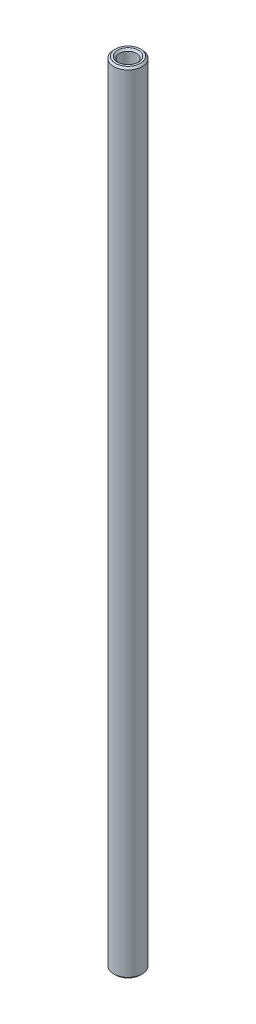
ISO-10303-21;
HEADER;
FILE_DESCRIPTION(('STEP AP214'),'2;1');
FILE_NAME('part.step','',(''),(''),'','','');
FILE_SCHEMA(('AUTOMOTIVE_DESIGN { 1 0 10303 214 1 1 1 1 }'));
ENDSEC;
DATA;
#1=APPLICATION_CONTEXT('core data for automotive mechanical design processes');
#2=APPLICATION_PROTOCOL_DEFINITION('international standard','automotive_design',2000,#1);
#3=PRODUCT_CONTEXT('',#1,'mechanical');
#4=PRODUCT('Part','Part','',(#3));
#5=PRODUCT_RELATED_PRODUCT_CATEGORY('part','',(#4));
#6=PRODUCT_DEFINITION_FORMATION('','',#4);
#7=PRODUCT_DEFINITION_CONTEXT('part definition',#1,'design');
#8=PRODUCT_DEFINITION('design','',#6,#7);
#9=PRODUCT_DEFINITION_SHAPE('','',#8);
#10=(LENGTH_UNIT() NAMED_UNIT(*) SI_UNIT(.MILLI.,.METRE.));
#11=(NAMED_UNIT(*) PLANE_ANGLE_UNIT() SI_UNIT($,.RADIAN.));
#12=(NAMED_UNIT(*) SI_UNIT($,.STERADIAN.) SOLID_ANGLE_UNIT());
#13=UNCERTAINTY_MEASURE_WITH_UNIT(LENGTH_MEASURE(1.E-05),#10,'distance_accuracy_value','');
#14=(GEOMETRIC_REPRESENTATION_CONTEXT(3) GLOBAL_UNCERTAINTY_ASSIGNED_CONTEXT((#13)) GLOBAL_UNIT_ASSIGNED_CONTEXT((#10,
#11,#12)) REPRESENTATION_CONTEXT('',''));
#15=CARTESIAN_POINT('',(0.,0.,0.));
#16=DIRECTION('',(0.,0.,1.));
#17=DIRECTION('',(1.,0.,0.));
#18=AXIS2_PLACEMENT_3D('',#15,#16,#17);
#19=CARTESIAN_POINT('',(0.,54.76875,0.));
#20=DIRECTION('',(0.,1.,0.));
#21=DIRECTION('',(0.,0.,1.));
#22=AXIS2_PLACEMENT_3D('',#19,#20,#21);
#23=PLANE('',#22);
#24=CARTESIAN_POINT('',(0.,54.76875,0.));
#25=DIRECTION('',(0.,1.,0.));
#26=DIRECTION('',(0.,0.,1.));
#27=AXIS2_PLACEMENT_3D('',#24,#25,#26);
#28=CIRCLE('',#27,1.44462499999999);
#29=CARTESIAN_POINT('',(0.,54.76875,1.44462499999999));
#30=VERTEX_POINT('',#29);
#31=EDGE_CURVE('E10',#30,#30,#28,.F.);
#32=ORIENTED_EDGE('',*,*,#31,.T.);
#33=EDGE_LOOP('',(#32));
#34=FACE_BOUND('',#33,.T.);
#35=CARTESIAN_POINT('',(0.,54.76875,0.));
#36=DIRECTION('',(0.,1.,0.));
#37=DIRECTION('',(0.,0.,1.));
#38=AXIS2_PLACEMENT_3D('',#35,#36,#37);
#39=CIRCLE('',#38,1.73037499999999);
#40=CARTESIAN_POINT('',(0.,54.76875,1.73037499999999));
#41=VERTEX_POINT('',#40);
#42=EDGE_CURVE('E41',#41,#41,#39,.T.);
#43=ORIENTED_EDGE('',*,*,#42,.T.);
#44=EDGE_LOOP('',(#43));
#45=FACE_BOUND('',#44,.T.);
#46=ADVANCED_FACE('F33',(#34,#45),#23,.T.);
#47=CARTESIAN_POINT('',(0.,-54.76875,0.));
#48=DIRECTION('',(0.,1.,0.));
#49=DIRECTION('',(0.,0.,1.));
#50=AXIS2_PLACEMENT_3D('',#47,#48,#49);
#51=PLANE('',#50);
#52=CARTESIAN_POINT('',(0.,-54.76875,0.));
#53=DIRECTION('',(0.,1.,0.));
#54=DIRECTION('',(0.,0.,1.));
#55=AXIS2_PLACEMENT_3D('',#52,#53,#54);
#56=CIRCLE('',#55,1.44462499999999);
#57=CARTESIAN_POINT('',(0.,-54.76875,1.44462499999999));
#58=VERTEX_POINT('',#57);
#59=EDGE_CURVE('E60',#58,#58,#56,.T.);
#60=ORIENTED_EDGE('',*,*,#59,.T.);
#61=EDGE_LOOP('',(#60));
#62=FACE_BOUND('',#61,.T.);
#63=CARTESIAN_POINT('',(0.,-54.76875,0.));
#64=DIRECTION('',(0.,1.,0.));
#65=DIRECTION('',(0.,0.,1.));
#66=AXIS2_PLACEMENT_3D('',#63,#64,#65);
#67=CIRCLE('',#66,1.73037500000002);
#68=CARTESIAN_POINT('',(0.,-54.76875,1.73037500000002));
#69=VERTEX_POINT('',#68);
#70=EDGE_CURVE('E63',#69,#69,#67,.F.);
#71=ORIENTED_EDGE('',*,*,#70,.T.);
#72=EDGE_LOOP('',(#71));
#73=FACE_BOUND('',#72,.T.);
#74=ADVANCED_FACE('F67',(#62,#73),#51,.F.);
#75=CARTESIAN_POINT('',(0.,54.76875,0.));
#76=DIRECTION('',(0.,-1.,0.));
#77=DIRECTION('',(0.,0.,-1.));
#78=AXIS2_PLACEMENT_3D('',#75,#76,#77);
#79=CYLINDRICAL_SURFACE('',#78,1.984375);
#80=CARTESIAN_POINT('',(0.,-54.51475,0.));
#81=DIRECTION('',(0.,1.,0.));
#82=DIRECTION('',(0.,0.,1.));
#83=AXIS2_PLACEMENT_3D('',#80,#81,#82);
#84=CIRCLE('',#83,1.984375);
#85=CARTESIAN_POINT('',(0.,-54.51475,1.984375));
#86=VERTEX_POINT('',#85);
#87=EDGE_CURVE('E45',#86,#86,#84,.T.);
#88=ORIENTED_EDGE('',*,*,#87,.T.);
#89=EDGE_LOOP('',(#88));
#90=FACE_BOUND('',#89,.T.);
#91=CARTESIAN_POINT('',(0.,54.51475,0.));
#92=DIRECTION('',(0.,1.,0.));
#93=DIRECTION('',(0.,0.,1.));
#94=AXIS2_PLACEMENT_3D('',#91,#92,#93);
#95=CIRCLE('',#94,1.984375);
#96=CARTESIAN_POINT('',(0.,54.51475,1.984375));
#97=VERTEX_POINT('',#96);
#98=EDGE_CURVE('E49',#97,#97,#95,.F.);
#99=ORIENTED_EDGE('',*,*,#98,.T.);
#100=EDGE_LOOP('',(#99));
#101=FACE_BOUND('',#100,.T.);
#102=ADVANCED_FACE('F77',(#90,#101),#79,.T.);
#103=CARTESIAN_POINT('',(0.,54.76875,0.));
#104=DIRECTION('',(0.,-1.,0.));
#105=DIRECTION('',(0.,0.,-1.));
#106=AXIS2_PLACEMENT_3D('',#103,#104,#105);
#107=CYLINDRICAL_SURFACE('',#106,1.190625);
#108=CARTESIAN_POINT('',(0.,-54.51475,0.));
#109=DIRECTION('',(0.,1.,0.));
#110=DIRECTION('',(0.,0.,1.));
#111=AXIS2_PLACEMENT_3D('',#108,#109,#110);
#112=CIRCLE('',#111,1.190625);
#113=CARTESIAN_POINT('',(0.,-54.51475,1.190625));
#114=VERTEX_POINT('',#113);
#115=EDGE_CURVE('E54',#114,#114,#112,.F.);
#116=ORIENTED_EDGE('',*,*,#115,.T.);
#117=EDGE_LOOP('',(#116));
#118=FACE_BOUND('',#117,.T.);
#119=CARTESIAN_POINT('',(0.,54.51475,0.));
#120=DIRECTION('',(0.,1.,0.));
#121=DIRECTION('',(0.,0.,1.));
#122=AXIS2_PLACEMENT_3D('',#119,#120,#121);
#123=CIRCLE('',#122,1.190625);
#124=CARTESIAN_POINT('',(0.,54.51475,1.190625));
#125=VERTEX_POINT('',#124);
#126=EDGE_CURVE('E57',#125,#125,#123,.T.);
#127=ORIENTED_EDGE('',*,*,#126,.T.);
#128=EDGE_LOOP('',(#127));
#129=FACE_BOUND('',#128,.T.);
#130=ADVANCED_FACE('F80',(#118,#129),#107,.F.);
#131=CARTESIAN_POINT('',(0.,-54.76875,0.));
#132=DIRECTION('',(0.,-1.,0.));
#133=DIRECTION('',(0.,0.,-1.));
#134=AXIS2_PLACEMENT_3D('',#131,#132,#133);
#135=CONICAL_SURFACE('',#134,1.44462499999999,0.78539816339745);
#136=ORIENTED_EDGE('',*,*,#115,.F.);
#137=EDGE_LOOP('',(#136));
#138=FACE_BOUND('',#137,.T.);
#139=ORIENTED_EDGE('',*,*,#59,.F.);
#140=EDGE_LOOP('',(#139));
#141=FACE_BOUND('',#140,.T.);
#142=ADVANCED_FACE('F73',(#138,#141),#135,.F.);
#143=CARTESIAN_POINT('',(0.,-54.51475,0.));
#144=DIRECTION('',(0.,1.,0.));
#145=DIRECTION('',(0.,0.,1.));
#146=AXIS2_PLACEMENT_3D('',#143,#144,#145);
#147=CONICAL_SURFACE('',#146,1.984375,0.785398163397455);
#148=ORIENTED_EDGE('',*,*,#70,.F.);
#149=EDGE_LOOP('',(#148));
#150=FACE_BOUND('',#149,.T.);
#151=ORIENTED_EDGE('',*,*,#87,.F.);
#152=EDGE_LOOP('',(#151));
#153=FACE_BOUND('',#152,.T.);
#154=ADVANCED_FACE('F69',(#150,#153),#147,.T.);
#155=CARTESIAN_POINT('',(0.,54.51475,0.));
#156=DIRECTION('',(0.,1.,0.));
#157=DIRECTION('',(0.,0.,1.));
#158=AXIS2_PLACEMENT_3D('',#155,#156,#157);
#159=CONICAL_SURFACE('',#158,1.190625,0.785398163397422);
#160=ORIENTED_EDGE('',*,*,#31,.F.);
#161=EDGE_LOOP('',(#160));
#162=FACE_BOUND('',#161,.T.);
#163=ORIENTED_EDGE('',*,*,#126,.F.);
#164=EDGE_LOOP('',(#163));
#165=FACE_BOUND('',#164,.T.);
#166=ADVANCED_FACE('F72',(#162,#165),#159,.F.);
#167=CARTESIAN_POINT('',(0.,54.76875,0.));
#168=DIRECTION('',(0.,-1.,0.));
#169=DIRECTION('',(0.,0.,-1.));
#170=AXIS2_PLACEMENT_3D('',#167,#168,#169);
#171=CONICAL_SURFACE('',#170,1.73037499999999,0.785398163397428);
#172=ORIENTED_EDGE('',*,*,#98,.F.);
#173=EDGE_LOOP('',(#172));
#174=FACE_BOUND('',#173,.T.);
#175=ORIENTED_EDGE('',*,*,#42,.F.);
#176=EDGE_LOOP('',(#175));
#177=FACE_BOUND('',#176,.T.);
#178=ADVANCED_FACE('F36',(#174,#177),#171,.T.);
#179=CLOSED_SHELL('',(#46,#74,#102,#130,#142,#154,#166,#178));
#180=MANIFOLD_SOLID_BREP('B2',#179);
#181=ADVANCED_BREP_SHAPE_REPRESENTATION('',(#18,#180),#14);
#182=SHAPE_DEFINITION_REPRESENTATION(#9,#181);
ENDSEC;
END-ISO-10303-21;
